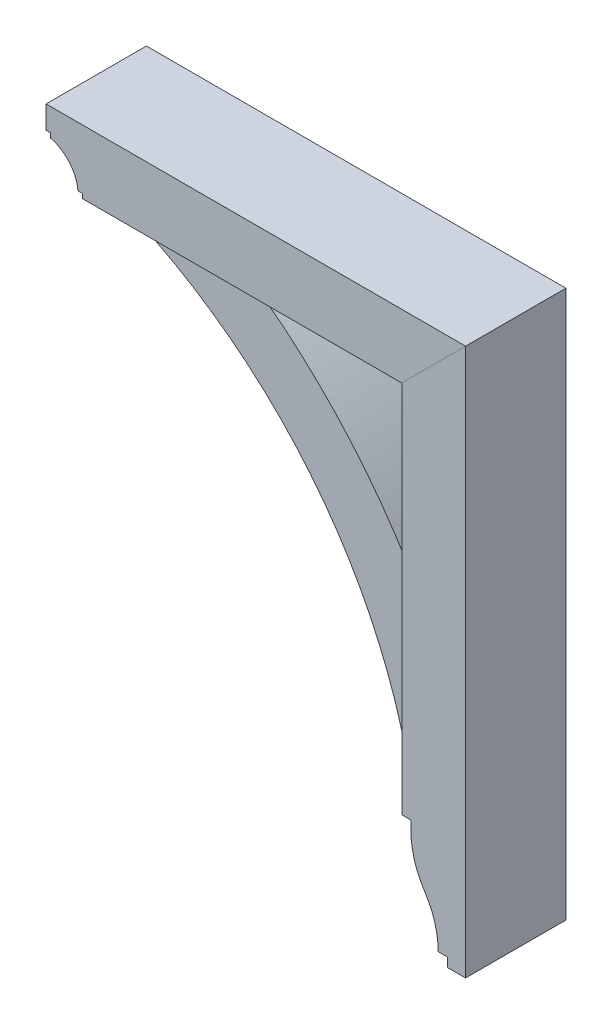
ISO-10303-21;
HEADER;
FILE_DESCRIPTION(('STEP AP214'),'2;1');
FILE_NAME('part.step','',(''),(''),'','','');
FILE_SCHEMA(('AUTOMOTIVE_DESIGN { 1 0 10303 214 1 1 1 1 }'));
ENDSEC;
DATA;
#1=APPLICATION_CONTEXT('core data for automotive mechanical design processes');
#2=APPLICATION_PROTOCOL_DEFINITION('international standard','automotive_design',2000,#1);
#3=PRODUCT_CONTEXT('',#1,'mechanical');
#4=PRODUCT('Part','Part','',(#3));
#5=PRODUCT_RELATED_PRODUCT_CATEGORY('part','',(#4));
#6=PRODUCT_DEFINITION_FORMATION('','',#4);
#7=PRODUCT_DEFINITION_CONTEXT('part definition',#1,'design');
#8=PRODUCT_DEFINITION('design','',#6,#7);
#9=PRODUCT_DEFINITION_SHAPE('','',#8);
#10=(LENGTH_UNIT() NAMED_UNIT(*) SI_UNIT(.MILLI.,.METRE.));
#11=(NAMED_UNIT(*) PLANE_ANGLE_UNIT() SI_UNIT($,.RADIAN.));
#12=(NAMED_UNIT(*) SI_UNIT($,.STERADIAN.) SOLID_ANGLE_UNIT());
#13=UNCERTAINTY_MEASURE_WITH_UNIT(LENGTH_MEASURE(1.E-05),#10,'distance_accuracy_value','');
#14=(GEOMETRIC_REPRESENTATION_CONTEXT(3) GLOBAL_UNCERTAINTY_ASSIGNED_CONTEXT((#13)) GLOBAL_UNIT_ASSIGNED_CONTEXT((#10,
#11,#12)) REPRESENTATION_CONTEXT('',''));
#15=CARTESIAN_POINT('',(0.,0.,0.));
#16=DIRECTION('',(0.,0.,1.));
#17=DIRECTION('',(1.,0.,0.));
#18=AXIS2_PLACEMENT_3D('',#15,#16,#17);
#19=CARTESIAN_POINT('',(246.881223015558,-2.15821431605898E-12,69.85));
#20=DIRECTION('',(1.,0.,0.));
#21=DIRECTION('',(0.,1.,0.));
#22=AXIS2_PLACEMENT_3D('',#19,#20,#21);
#23=PLANE('',#22);
#24=DIRECTION('',(0.,-1.,0.));
#25=VECTOR('',#24,1.);
#26=CARTESIAN_POINT('',(246.881223015558,-2.15821431605898E-12,-69.85));
#27=LINE('',#26,#25);
#28=CARTESIAN_POINT('',(246.881223015556,-183.515,-69.85));
#29=VERTEX_POINT('',#28);
#30=CARTESIAN_POINT('',(246.881223015556,-196.215,-69.85));
#31=VERTEX_POINT('',#30);
#32=EDGE_CURVE('E176',#29,#31,#27,.T.);
#33=ORIENTED_EDGE('',*,*,#32,.T.);
#34=DIRECTION('',(0.,0.,-1.));
#35=VECTOR('',#34,1.);
#36=CARTESIAN_POINT('',(246.881223015556,-196.215,69.85));
#37=LINE('',#36,#35);
#38=CARTESIAN_POINT('',(246.881223015556,-196.215,69.85));
#39=VERTEX_POINT('',#38);
#40=EDGE_CURVE('E12',#39,#31,#37,.T.);
#41=ORIENTED_EDGE('',*,*,#40,.F.);
#42=DIRECTION('',(0.,-1.,0.));
#43=VECTOR('',#42,1.);
#44=CARTESIAN_POINT('',(246.881223015558,-2.15821431605898E-12,69.85));
#45=LINE('',#44,#43);
#46=CARTESIAN_POINT('',(246.881223015556,-183.515,69.85));
#47=VERTEX_POINT('',#46);
#48=EDGE_CURVE('E208',#47,#39,#45,.T.);
#49=ORIENTED_EDGE('',*,*,#48,.F.);
#50=DIRECTION('',(0.,0.,-1.));
#51=VECTOR('',#50,1.);
#52=CARTESIAN_POINT('',(246.881223015556,-183.515,69.85));
#53=LINE('',#52,#51);
#54=EDGE_CURVE('E172',#47,#29,#53,.T.);
#55=ORIENTED_EDGE('',*,*,#54,.T.);
#56=EDGE_LOOP('',(#33,#41,#49,#55));
#57=FACE_BOUND('',#56,.T.);
#58=ADVANCED_FACE('F60',(#57),#23,.F.);
#59=CARTESIAN_POINT('',(362.768723015556,-196.215,69.85));
#60=DIRECTION('',(0.,0.,-1.));
#61=DIRECTION('',(-1.,0.,0.));
#62=AXIS2_PLACEMENT_3D('',#59,#60,#61);
#63=CYLINDRICAL_SURFACE('',#62,115.8875);
#64=CARTESIAN_POINT('',(362.768723015556,-196.215,-69.85));
#65=DIRECTION('',(0.,0.,1.));
#66=DIRECTION('',(1.,0.,0.));
#67=AXIS2_PLACEMENT_3D('',#64,#65,#66);
#68=CIRCLE('',#67,115.8875);
#69=CARTESIAN_POINT('',(266.018608336656,-260.006284403668,-69.85));
#70=VERTEX_POINT('',#69);
#71=EDGE_CURVE('E180',#31,#70,#68,.T.);
#72=ORIENTED_EDGE('',*,*,#71,.T.);
#73=DIRECTION('',(0.,0.,-1.));
#74=VECTOR('',#73,1.);
#75=CARTESIAN_POINT('',(266.018608336656,-260.006284403668,69.85));
#76=LINE('',#75,#74);
#77=CARTESIAN_POINT('',(266.018608336656,-260.006284403668,69.85));
#78=VERTEX_POINT('',#77);
#79=EDGE_CURVE('E69',#78,#70,#76,.T.);
#80=ORIENTED_EDGE('',*,*,#79,.F.);
#81=CARTESIAN_POINT('',(362.768723015556,-196.215,69.85));
#82=DIRECTION('',(0.,0.,1.));
#83=DIRECTION('',(1.,0.,0.));
#84=AXIS2_PLACEMENT_3D('',#81,#82,#83);
#85=CIRCLE('',#84,115.8875);
#86=EDGE_CURVE('E126',#39,#78,#85,.T.);
#87=ORIENTED_EDGE('',*,*,#86,.F.);
#88=ORIENTED_EDGE('',*,*,#40,.T.);
#89=EDGE_LOOP('',(#72,#80,#87,#88));
#90=FACE_BOUND('',#89,.T.);
#91=ADVANCED_FACE('F235',(#90),#63,.T.);
#92=CARTESIAN_POINT('',(170.152056348884,-323.215,69.85));
#93=DIRECTION('',(0.,0.,-1.));
#94=DIRECTION('',(-1.,0.,0.));
#95=AXIS2_PLACEMENT_3D('',#92,#93,#94);
#96=CYLINDRICAL_SURFACE('',#95,114.829166666671);
#97=CARTESIAN_POINT('',(170.152056348884,-323.215,-69.85));
#98=DIRECTION('',(0.,0.,1.));
#99=DIRECTION('',(1.,0.,0.));
#100=AXIS2_PLACEMENT_3D('',#97,#98,#99);
#101=CIRCLE('',#100,114.829166666671);
#102=CARTESIAN_POINT('',(284.981223015555,-323.215,-69.85));
#103=VERTEX_POINT('',#102);
#104=EDGE_CURVE('E184',#103,#70,#101,.T.);
#105=ORIENTED_EDGE('',*,*,#104,.F.);
#106=DIRECTION('',(0.,0.,-1.));
#107=VECTOR('',#106,1.);
#108=CARTESIAN_POINT('',(284.981223015555,-323.215,69.85));
#109=LINE('',#108,#107);
#110=CARTESIAN_POINT('',(284.981223015555,-323.215,69.85));
#111=VERTEX_POINT('',#110);
#112=EDGE_CURVE('E224',#111,#103,#109,.T.);
#113=ORIENTED_EDGE('',*,*,#112,.F.);
#114=CARTESIAN_POINT('',(170.152056348884,-323.215,69.85));
#115=DIRECTION('',(0.,0.,1.));
#116=DIRECTION('',(1.,0.,0.));
#117=AXIS2_PLACEMENT_3D('',#114,#115,#116);
#118=CIRCLE('',#117,114.829166666671);
#119=EDGE_CURVE('E234',#111,#78,#118,.T.);
#120=ORIENTED_EDGE('',*,*,#119,.T.);
#121=ORIENTED_EDGE('',*,*,#79,.T.);
#122=EDGE_LOOP('',(#105,#113,#120,#121));
#123=FACE_BOUND('',#122,.T.);
#124=ADVANCED_FACE('F232',(#123),#96,.F.);
#125=CARTESIAN_POINT('',(0.,-323.215,69.85));
#126=DIRECTION('',(0.,-1.,0.));
#127=DIRECTION('',(0.,0.,-1.));
#128=AXIS2_PLACEMENT_3D('',#125,#126,#127);
#129=PLANE('',#128);
#130=DIRECTION('',(-1.,0.,0.));
#131=VECTOR('',#130,1.);
#132=CARTESIAN_POINT('',(0.,-323.215,-69.85));
#133=LINE('',#132,#131);
#134=CARTESIAN_POINT('',(297.681223015555,-323.215,-69.85));
#135=VERTEX_POINT('',#134);
#136=EDGE_CURVE('E188',#135,#103,#133,.T.);
#137=ORIENTED_EDGE('',*,*,#136,.F.);
#138=DIRECTION('',(0.,0.,-1.));
#139=VECTOR('',#138,1.);
#140=CARTESIAN_POINT('',(297.681223015555,-323.215,69.85));
#141=LINE('',#140,#139);
#142=CARTESIAN_POINT('',(297.681223015555,-323.215,69.85));
#143=VERTEX_POINT('',#142);
#144=EDGE_CURVE('E221',#143,#135,#141,.T.);
#145=ORIENTED_EDGE('',*,*,#144,.F.);
#146=DIRECTION('',(-1.,0.,0.));
#147=VECTOR('',#146,1.);
#148=CARTESIAN_POINT('',(0.,-323.215,69.85));
#149=LINE('',#148,#147);
#150=EDGE_CURVE('E246',#143,#111,#149,.T.);
#151=ORIENTED_EDGE('',*,*,#150,.T.);
#152=ORIENTED_EDGE('',*,*,#112,.T.);
#153=EDGE_LOOP('',(#137,#145,#151,#152));
#154=FACE_BOUND('',#153,.T.);
#155=ADVANCED_FACE('F243',(#154),#129,.T.);
#156=CARTESIAN_POINT('',(297.681223015555,0.,69.85));
#157=DIRECTION('',(-1.,0.,0.));
#158=DIRECTION('',(0.,0.,1.));
#159=AXIS2_PLACEMENT_3D('',#156,#157,#158);
#160=PLANE('',#159);
#161=DIRECTION('',(0.,1.,0.));
#162=VECTOR('',#161,1.);
#163=CARTESIAN_POINT('',(297.681223015555,0.,-69.85));
#164=LINE('',#163,#162);
#165=CARTESIAN_POINT('',(297.681223015555,-335.915,-69.85));
#166=VERTEX_POINT('',#165);
#167=EDGE_CURVE('E192',#166,#135,#164,.T.);
#168=ORIENTED_EDGE('',*,*,#167,.F.);
#169=DIRECTION('',(0.,0.,-1.));
#170=VECTOR('',#169,1.);
#171=CARTESIAN_POINT('',(297.681223015555,-335.915,69.85));
#172=LINE('',#171,#170);
#173=CARTESIAN_POINT('',(297.681223015555,-335.915,69.85));
#174=VERTEX_POINT('',#173);
#175=EDGE_CURVE('E218',#174,#166,#172,.T.);
#176=ORIENTED_EDGE('',*,*,#175,.F.);
#177=DIRECTION('',(0.,1.,0.));
#178=VECTOR('',#177,1.);
#179=CARTESIAN_POINT('',(297.681223015555,0.,69.85));
#180=LINE('',#179,#178);
#181=EDGE_CURVE('E252',#174,#143,#180,.T.);
#182=ORIENTED_EDGE('',*,*,#181,.T.);
#183=ORIENTED_EDGE('',*,*,#144,.T.);
#184=EDGE_LOOP('',(#168,#176,#182,#183));
#185=FACE_BOUND('',#184,.T.);
#186=ADVANCED_FACE('F300',(#185),#160,.T.);
#187=CARTESIAN_POINT('',(7.34134975033387E-13,-335.915000000001,69.85));
#188=DIRECTION('',(0.,-1.,0.));
#189=DIRECTION('',(1.,0.,0.));
#190=AXIS2_PLACEMENT_3D('',#187,#188,#189);
#191=PLANE('',#190);
#192=DIRECTION('',(-1.,0.,0.));
#193=VECTOR('',#192,1.);
#194=CARTESIAN_POINT('',(7.34134975033387E-13,-335.915000000001,-69.85));
#195=LINE('',#194,#193);
#196=CARTESIAN_POINT('',(323.081223015555,-335.915,-69.85));
#197=VERTEX_POINT('',#196);
#198=EDGE_CURVE('E196',#197,#166,#195,.T.);
#199=ORIENTED_EDGE('',*,*,#198,.F.);
#200=DIRECTION('',(0.,0.,-1.));
#201=VECTOR('',#200,1.);
#202=CARTESIAN_POINT('',(323.081223015555,-335.915,69.85));
#203=LINE('',#202,#201);
#204=CARTESIAN_POINT('',(323.081223015555,-335.915,69.85));
#205=VERTEX_POINT('',#204);
#206=EDGE_CURVE('E215',#205,#197,#203,.T.);
#207=ORIENTED_EDGE('',*,*,#206,.F.);
#208=DIRECTION('',(-1.,0.,0.));
#209=VECTOR('',#208,1.);
#210=CARTESIAN_POINT('',(7.34134975033387E-13,-335.915000000001,69.85));
#211=LINE('',#210,#209);
#212=EDGE_CURVE('E260',#205,#174,#211,.T.);
#213=ORIENTED_EDGE('',*,*,#212,.T.);
#214=ORIENTED_EDGE('',*,*,#175,.T.);
#215=EDGE_LOOP('',(#199,#207,#213,#214));
#216=FACE_BOUND('',#215,.T.);
#217=ADVANCED_FACE('F298',(#216),#191,.T.);
#218=CARTESIAN_POINT('',(323.081223015555,0.,69.85));
#219=DIRECTION('',(-1.,0.,0.));
#220=DIRECTION('',(0.,0.,1.));
#221=AXIS2_PLACEMENT_3D('',#218,#219,#220);
#222=PLANE('',#221);
#223=DIRECTION('',(0.,1.,0.));
#224=VECTOR('',#223,1.);
#225=CARTESIAN_POINT('',(323.081223015555,0.,-69.85));
#226=LINE('',#225,#224);
#227=CARTESIAN_POINT('',(323.081223015555,426.085,-69.85));
#228=VERTEX_POINT('',#227);
#229=EDGE_CURVE('E200',#197,#228,#226,.T.);
#230=ORIENTED_EDGE('',*,*,#229,.T.);
#231=DIRECTION('',(0.,0.,-1.));
#232=VECTOR('',#231,1.);
#233=CARTESIAN_POINT('',(323.081223015555,426.085,69.85));
#234=LINE('',#233,#232);
#235=CARTESIAN_POINT('',(323.081223015555,426.085,69.85));
#236=VERTEX_POINT('',#235);
#237=EDGE_CURVE('E163',#236,#228,#234,.T.);
#238=ORIENTED_EDGE('',*,*,#237,.F.);
#239=DIRECTION('',(0.,1.,0.));
#240=VECTOR('',#239,1.);
#241=CARTESIAN_POINT('',(323.081223015555,0.,69.85));
#242=LINE('',#241,#240);
#243=EDGE_CURVE('E152',#205,#236,#242,.T.);
#244=ORIENTED_EDGE('',*,*,#243,.F.);
#245=ORIENTED_EDGE('',*,*,#206,.T.);
#246=EDGE_LOOP('',(#230,#238,#244,#245));
#247=FACE_BOUND('',#246,.T.);
#248=ADVANCED_FACE('F307',(#247),#222,.F.);
#249=CARTESIAN_POINT('',(-51.5018884922205,51.5018884922198,69.85));
#250=DIRECTION('',(0.707106781186552,-0.707106781186543,0.));
#251=DIRECTION('',(0.707106781186543,0.707106781186552,0.));
#252=AXIS2_PLACEMENT_3D('',#249,#250,#251);
#253=PLANE('',#252);
#254=DIRECTION('',(-0.707106781186543,-0.707106781186552,0.));
#255=VECTOR('',#254,1.);
#256=CARTESIAN_POINT('',(-51.5018884922205,51.5018884922198,-69.85));
#257=LINE('',#256,#255);
#258=CARTESIAN_POINT('',(234.181223015556,337.185,-69.85));
#259=VERTEX_POINT('',#258);
#260=EDGE_CURVE('E161',#228,#259,#257,.T.);
#261=ORIENTED_EDGE('',*,*,#260,.T.);
#262=DIRECTION('',(0.,0.,-1.));
#263=VECTOR('',#262,1.);
#264=CARTESIAN_POINT('',(234.181223015556,337.185,69.85));
#265=LINE('',#264,#263);
#266=CARTESIAN_POINT('',(234.181223015556,337.185,69.85));
#267=VERTEX_POINT('',#266);
#268=EDGE_CURVE('E158',#267,#259,#265,.T.);
#269=ORIENTED_EDGE('',*,*,#268,.F.);
#270=DIRECTION('',(-0.707106781186543,-0.707106781186552,0.));
#271=VECTOR('',#270,1.);
#272=CARTESIAN_POINT('',(-51.5018884922205,51.5018884922198,69.85));
#273=LINE('',#272,#271);
#274=EDGE_CURVE('E145',#236,#267,#273,.T.);
#275=ORIENTED_EDGE('',*,*,#274,.F.);
#276=ORIENTED_EDGE('',*,*,#237,.T.);
#277=EDGE_LOOP('',(#261,#269,#275,#276));
#278=FACE_BOUND('',#277,.T.);
#279=ADVANCED_FACE('F159',(#278),#253,.F.);
#280=CARTESIAN_POINT('',(234.181223015556,0.,69.85));
#281=DIRECTION('',(1.,0.,0.));
#282=DIRECTION('',(0.,1.,0.));
#283=AXIS2_PLACEMENT_3D('',#280,#281,#282);
#284=PLANE('',#283);
#285=DIRECTION('',(0.,-1.,0.));
#286=VECTOR('',#285,1.);
#287=CARTESIAN_POINT('',(234.181223015556,0.,-69.85));
#288=LINE('',#287,#286);
#289=CARTESIAN_POINT('',(234.181223015556,-183.515,-69.85));
#290=VERTEX_POINT('',#289);
#291=EDGE_CURVE('E112',#259,#290,#288,.T.);
#292=ORIENTED_EDGE('',*,*,#291,.T.);
#293=DIRECTION('',(0.,0.,-1.));
#294=VECTOR('',#293,1.);
#295=CARTESIAN_POINT('',(234.181223015556,-183.515,69.85));
#296=LINE('',#295,#294);
#297=CARTESIAN_POINT('',(234.181223015556,-183.515,69.85));
#298=VERTEX_POINT('',#297);
#299=EDGE_CURVE('E164',#298,#290,#296,.T.);
#300=ORIENTED_EDGE('',*,*,#299,.F.);
#301=DIRECTION('',(0.,-1.,0.));
#302=VECTOR('',#301,1.);
#303=CARTESIAN_POINT('',(234.181223015556,0.,69.85));
#304=LINE('',#303,#302);
#305=EDGE_CURVE('E149',#267,#298,#304,.T.);
#306=ORIENTED_EDGE('',*,*,#305,.F.);
#307=ORIENTED_EDGE('',*,*,#268,.T.);
#308=EDGE_LOOP('',(#292,#300,#306,#307));
#309=FACE_BOUND('',#308,.T.);
#310=ADVANCED_FACE('F166',(#309),#284,.F.);
#311=CARTESIAN_POINT('',(0.,-183.515,69.85));
#312=DIRECTION('',(0.,1.,0.));
#313=DIRECTION('',(0.,0.,1.));
#314=AXIS2_PLACEMENT_3D('',#311,#312,#313);
#315=PLANE('',#314);
#316=DIRECTION('',(1.,0.,0.));
#317=VECTOR('',#316,1.);
#318=CARTESIAN_POINT('',(0.,-183.515,-69.85));
#319=LINE('',#318,#317);
#320=EDGE_CURVE('E118',#290,#29,#319,.T.);
#321=ORIENTED_EDGE('',*,*,#320,.T.);
#322=ORIENTED_EDGE('',*,*,#54,.F.);
#323=DIRECTION('',(1.,0.,0.));
#324=VECTOR('',#323,1.);
#325=CARTESIAN_POINT('',(0.,-183.515,69.85));
#326=LINE('',#325,#324);
#327=EDGE_CURVE('E77',#298,#47,#326,.T.);
#328=ORIENTED_EDGE('',*,*,#327,.F.);
#329=ORIENTED_EDGE('',*,*,#299,.T.);
#330=EDGE_LOOP('',(#321,#322,#328,#329));
#331=FACE_BOUND('',#330,.T.);
#332=ADVANCED_FACE('F347',(#331),#315,.F.);
#333=CARTESIAN_POINT('',(0.,0.,69.85));
#334=DIRECTION('',(0.,0.,1.));
#335=DIRECTION('',(1.,0.,0.));
#336=AXIS2_PLACEMENT_3D('',#333,#334,#335);
#337=PLANE('',#336);
#338=ORIENTED_EDGE('',*,*,#48,.T.);
#339=ORIENTED_EDGE('',*,*,#86,.T.);
#340=ORIENTED_EDGE('',*,*,#119,.F.);
#341=ORIENTED_EDGE('',*,*,#150,.F.);
#342=ORIENTED_EDGE('',*,*,#181,.F.);
#343=ORIENTED_EDGE('',*,*,#212,.F.);
#344=ORIENTED_EDGE('',*,*,#243,.T.);
#345=ORIENTED_EDGE('',*,*,#274,.T.);
#346=ORIENTED_EDGE('',*,*,#305,.T.);
#347=ORIENTED_EDGE('',*,*,#327,.T.);
#348=EDGE_LOOP('',(#338,#339,#340,#341,#342,#343,#344,#345,#346,#347));
#349=FACE_BOUND('',#348,.T.);
#350=ADVANCED_FACE('F147',(#349),#337,.T.);
#351=CARTESIAN_POINT('',(0.,0.,-69.85));
#352=DIRECTION('',(0.,0.,1.));
#353=DIRECTION('',(1.,0.,0.));
#354=AXIS2_PLACEMENT_3D('',#351,#352,#353);
#355=PLANE('',#354);
#356=ORIENTED_EDGE('',*,*,#32,.F.);
#357=ORIENTED_EDGE('',*,*,#320,.F.);
#358=ORIENTED_EDGE('',*,*,#291,.F.);
#359=ORIENTED_EDGE('',*,*,#260,.F.);
#360=ORIENTED_EDGE('',*,*,#229,.F.);
#361=ORIENTED_EDGE('',*,*,#198,.T.);
#362=ORIENTED_EDGE('',*,*,#167,.T.);
#363=ORIENTED_EDGE('',*,*,#136,.T.);
#364=ORIENTED_EDGE('',*,*,#104,.T.);
#365=ORIENTED_EDGE('',*,*,#71,.F.);
#366=EDGE_LOOP('',(#356,#357,#358,#359,#360,#361,#362,#363,#364,#365));
#367=FACE_BOUND('',#366,.T.);
#368=ADVANCED_FACE('F239',(#367),#355,.F.);
#369=CLOSED_SHELL('',(#58,#91,#124,#155,#186,#217,#248,#279,#310,#332,#350,#368));
#370=MANIFOLD_SOLID_BREP('B2',#369);
#371=CARTESIAN_POINT('',(-460.401944369243,-313.577975646319,44.45));
#372=DIRECTION('',(0.,0.,-1.));
#373=DIRECTION('',(-1.,0.,0.));
#374=AXIS2_PLACEMENT_3D('',#371,#372,#373);
#375=CYLINDRICAL_SURFACE('',#374,792.1625);
#376=CARTESIAN_POINT('',(-460.401944369243,-313.577975646319,-44.45));
#377=DIRECTION('',(0.,0.,1.));
#378=DIRECTION('',(1.,0.,0.));
#379=AXIS2_PLACEMENT_3D('',#376,#377,#378);
#380=CIRCLE('',#379,792.1625);
#381=CARTESIAN_POINT('',(-8.70627698444387,337.185,-44.45));
#382=VERTEX_POINT('',#381);
#383=CARTESIAN_POINT('',(234.181223015556,67.3099999999999,-44.45));
#384=VERTEX_POINT('',#383);
#385=EDGE_CURVE('E521',#382,#384,#380,.F.);
#386=ORIENTED_EDGE('',*,*,#385,.F.);
#387=DIRECTION('',(0.,0.,-1.));
#388=VECTOR('',#387,1.);
#389=CARTESIAN_POINT('',(-8.70627698444387,337.185,44.45));
#390=LINE('',#389,#388);
#391=CARTESIAN_POINT('',(-8.70627698444387,337.185,44.45));
#392=VERTEX_POINT('',#391);
#393=EDGE_CURVE('E58',#392,#382,#390,.T.);
#394=ORIENTED_EDGE('',*,*,#393,.F.);
#395=CARTESIAN_POINT('',(-460.401944369243,-313.577975646319,44.45));
#396=DIRECTION('',(0.,0.,1.));
#397=DIRECTION('',(1.,0.,0.));
#398=AXIS2_PLACEMENT_3D('',#395,#396,#397);
#399=CIRCLE('',#398,792.1625);
#400=CARTESIAN_POINT('',(234.181223015556,67.3099999999999,44.45));
#401=VERTEX_POINT('',#400);
#402=EDGE_CURVE('E539',#392,#401,#399,.F.);
#403=ORIENTED_EDGE('',*,*,#402,.T.);
#404=DIRECTION('',(0.,0.,-1.));
#405=VECTOR('',#404,1.);
#406=CARTESIAN_POINT('',(234.181223015556,67.3099999999999,44.45));
#407=LINE('',#406,#405);
#408=EDGE_CURVE('E450',#401,#384,#407,.T.);
#409=ORIENTED_EDGE('',*,*,#408,.T.);
#410=EDGE_LOOP('',(#386,#394,#403,#409));
#411=FACE_BOUND('',#410,.T.);
#412=ADVANCED_FACE('F433',(#411),#375,.T.);
#413=CARTESIAN_POINT('',(0.,337.185,44.45));
#414=DIRECTION('',(0.,1.,0.));
#415=DIRECTION('',(-1.,0.,0.));
#416=AXIS2_PLACEMENT_3D('',#413,#414,#415);
#417=PLANE('',#416);
#418=DIRECTION('',(1.,0.,0.));
#419=VECTOR('',#418,1.);
#420=CARTESIAN_POINT('',(0.,337.185,-44.45));
#421=LINE('',#420,#419);
#422=CARTESIAN_POINT('',(-134.118776984445,337.185,-44.45));
#423=VERTEX_POINT('',#422);
#424=EDGE_CURVE('E524',#423,#382,#421,.T.);
#425=ORIENTED_EDGE('',*,*,#424,.F.);
#426=DIRECTION('',(0.,0.,-1.));
#427=VECTOR('',#426,1.);
#428=CARTESIAN_POINT('',(-134.118776984445,337.185,44.45));
#429=LINE('',#428,#427);
#430=CARTESIAN_POINT('',(-134.118776984445,337.185,44.45));
#431=VERTEX_POINT('',#430);
#432=EDGE_CURVE('E442',#431,#423,#429,.T.);
#433=ORIENTED_EDGE('',*,*,#432,.F.);
#434=DIRECTION('',(1.,0.,0.));
#435=VECTOR('',#434,1.);
#436=CARTESIAN_POINT('',(0.,337.185,44.45));
#437=LINE('',#436,#435);
#438=EDGE_CURVE('E555',#431,#392,#437,.T.);
#439=ORIENTED_EDGE('',*,*,#438,.T.);
#440=ORIENTED_EDGE('',*,*,#393,.T.);
#441=EDGE_LOOP('',(#425,#433,#439,#440));
#442=FACE_BOUND('',#441,.T.);
#443=ADVANCED_FACE('F554',(#442),#417,.T.);
#444=CARTESIAN_POINT('',(-134.118776984445,0.,44.45));
#445=DIRECTION('',(1.,0.,0.));
#446=DIRECTION('',(0.,0.,-1.));
#447=AXIS2_PLACEMENT_3D('',#444,#445,#446);
#448=PLANE('',#447);
#449=DIRECTION('',(0.,-1.,0.));
#450=VECTOR('',#449,1.);
#451=CARTESIAN_POINT('',(-134.118776984445,0.,-44.45));
#452=LINE('',#451,#450);
#453=CARTESIAN_POINT('',(-134.118776984445,311.785,-44.45));
#454=VERTEX_POINT('',#453);
#455=EDGE_CURVE('E527',#423,#454,#452,.T.);
#456=ORIENTED_EDGE('',*,*,#455,.T.);
#457=DIRECTION('',(0.,0.,-1.));
#458=VECTOR('',#457,1.);
#459=CARTESIAN_POINT('',(-134.118776984445,311.785,44.45));
#460=LINE('',#459,#458);
#461=CARTESIAN_POINT('',(-134.118776984445,311.785,44.45));
#462=VERTEX_POINT('',#461);
#463=EDGE_CURVE('E510',#462,#454,#460,.T.);
#464=ORIENTED_EDGE('',*,*,#463,.F.);
#465=DIRECTION('',(0.,-1.,0.));
#466=VECTOR('',#465,1.);
#467=CARTESIAN_POINT('',(-134.118776984445,0.,44.45));
#468=LINE('',#467,#466);
#469=EDGE_CURVE('E496',#431,#462,#468,.T.);
#470=ORIENTED_EDGE('',*,*,#469,.F.);
#471=ORIENTED_EDGE('',*,*,#432,.T.);
#472=EDGE_LOOP('',(#456,#464,#470,#471));
#473=FACE_BOUND('',#472,.T.);
#474=ADVANCED_FACE('F548',(#473),#448,.F.);
#475=CARTESIAN_POINT('',(-436.930461003759,-285.797286924895,44.45));
#476=DIRECTION('',(0.,0.,-1.));
#477=DIRECTION('',(-1.,0.,0.));
#478=AXIS2_PLACEMENT_3D('',#475,#476,#477);
#479=CYLINDRICAL_SURFACE('',#478,669.925);
#480=CARTESIAN_POINT('',(-436.930461003759,-285.797286924895,-44.45));
#481=DIRECTION('',(0.,0.,1.));
#482=DIRECTION('',(1.,0.,0.));
#483=AXIS2_PLACEMENT_3D('',#480,#481,#482);
#484=CIRCLE('',#483,669.925);
#485=CARTESIAN_POINT('',(208.781223015556,-107.315,-44.45));
#486=VERTEX_POINT('',#485);
#487=EDGE_CURVE('E506',#454,#486,#484,.F.);
#488=ORIENTED_EDGE('',*,*,#487,.T.);
#489=DIRECTION('',(0.,0.,-1.));
#490=VECTOR('',#489,1.);
#491=CARTESIAN_POINT('',(208.781223015556,-107.315,44.45));
#492=LINE('',#491,#490);
#493=CARTESIAN_POINT('',(208.781223015556,-107.315,44.45));
#494=VERTEX_POINT('',#493);
#495=EDGE_CURVE('E503',#494,#486,#492,.T.);
#496=ORIENTED_EDGE('',*,*,#495,.F.);
#497=CARTESIAN_POINT('',(-436.930461003759,-285.797286924895,44.45));
#498=DIRECTION('',(0.,0.,1.));
#499=DIRECTION('',(1.,0.,0.));
#500=AXIS2_PLACEMENT_3D('',#497,#498,#499);
#501=CIRCLE('',#500,669.925);
#502=EDGE_CURVE('E488',#462,#494,#501,.F.);
#503=ORIENTED_EDGE('',*,*,#502,.F.);
#504=ORIENTED_EDGE('',*,*,#463,.T.);
#505=EDGE_LOOP('',(#488,#496,#503,#504));
#506=FACE_BOUND('',#505,.T.);
#507=ADVANCED_FACE('F504',(#506),#479,.F.);
#508=CARTESIAN_POINT('',(0.,-107.315,44.45));
#509=DIRECTION('',(0.,-1.,0.));
#510=DIRECTION('',(1.,0.,0.));
#511=AXIS2_PLACEMENT_3D('',#508,#509,#510);
#512=PLANE('',#511);
#513=DIRECTION('',(-1.,0.,0.));
#514=VECTOR('',#513,1.);
#515=CARTESIAN_POINT('',(0.,-107.315,-44.45));
#516=LINE('',#515,#514);
#517=CARTESIAN_POINT('',(234.181223015556,-107.315,-44.45));
#518=VERTEX_POINT('',#517);
#519=EDGE_CURVE('E532',#518,#486,#516,.T.);
#520=ORIENTED_EDGE('',*,*,#519,.F.);
#521=DIRECTION('',(0.,0.,-1.));
#522=VECTOR('',#521,1.);
#523=CARTESIAN_POINT('',(234.181223015556,-107.315,44.45));
#524=LINE('',#523,#522);
#525=CARTESIAN_POINT('',(234.181223015556,-107.315,44.45));
#526=VERTEX_POINT('',#525);
#527=EDGE_CURVE('E469',#526,#518,#524,.T.);
#528=ORIENTED_EDGE('',*,*,#527,.F.);
#529=DIRECTION('',(-1.,0.,0.));
#530=VECTOR('',#529,1.);
#531=CARTESIAN_POINT('',(0.,-107.315,44.45));
#532=LINE('',#531,#530);
#533=EDGE_CURVE('E493',#526,#494,#532,.T.);
#534=ORIENTED_EDGE('',*,*,#533,.T.);
#535=ORIENTED_EDGE('',*,*,#495,.T.);
#536=EDGE_LOOP('',(#520,#528,#534,#535));
#537=FACE_BOUND('',#536,.T.);
#538=ADVANCED_FACE('F512',(#537),#512,.T.);
#539=CARTESIAN_POINT('',(234.181223015556,0.,44.45));
#540=DIRECTION('',(1.,0.,0.));
#541=DIRECTION('',(0.,1.,0.));
#542=AXIS2_PLACEMENT_3D('',#539,#540,#541);
#543=PLANE('',#542);
#544=DIRECTION('',(0.,-1.,0.));
#545=VECTOR('',#544,1.);
#546=CARTESIAN_POINT('',(234.181223015556,0.,-44.45));
#547=LINE('',#546,#545);
#548=EDGE_CURVE('E535',#384,#518,#547,.T.);
#549=ORIENTED_EDGE('',*,*,#548,.F.);
#550=ORIENTED_EDGE('',*,*,#408,.F.);
#551=DIRECTION('',(0.,-1.,0.));
#552=VECTOR('',#551,1.);
#553=CARTESIAN_POINT('',(234.181223015556,0.,44.45));
#554=LINE('',#553,#552);
#555=EDGE_CURVE('E514',#401,#526,#554,.T.);
#556=ORIENTED_EDGE('',*,*,#555,.T.);
#557=ORIENTED_EDGE('',*,*,#527,.T.);
#558=EDGE_LOOP('',(#549,#550,#556,#557));
#559=FACE_BOUND('',#558,.T.);
#560=ADVANCED_FACE('F556',(#559),#543,.T.);
#561=CARTESIAN_POINT('',(0.,0.,44.45));
#562=DIRECTION('',(0.,0.,1.));
#563=DIRECTION('',(1.,0.,0.));
#564=AXIS2_PLACEMENT_3D('',#561,#562,#563);
#565=PLANE('',#564);
#566=ORIENTED_EDGE('',*,*,#402,.F.);
#567=ORIENTED_EDGE('',*,*,#438,.F.);
#568=ORIENTED_EDGE('',*,*,#469,.T.);
#569=ORIENTED_EDGE('',*,*,#502,.T.);
#570=ORIENTED_EDGE('',*,*,#533,.F.);
#571=ORIENTED_EDGE('',*,*,#555,.F.);
#572=EDGE_LOOP('',(#566,#567,#568,#569,#570,#571));
#573=FACE_BOUND('',#572,.T.);
#574=ADVANCED_FACE('F490',(#573),#565,.T.);
#575=CARTESIAN_POINT('',(0.,0.,-44.45));
#576=DIRECTION('',(0.,0.,1.));
#577=DIRECTION('',(1.,0.,0.));
#578=AXIS2_PLACEMENT_3D('',#575,#576,#577);
#579=PLANE('',#578);
#580=ORIENTED_EDGE('',*,*,#385,.T.);
#581=ORIENTED_EDGE('',*,*,#548,.T.);
#582=ORIENTED_EDGE('',*,*,#519,.T.);
#583=ORIENTED_EDGE('',*,*,#487,.F.);
#584=ORIENTED_EDGE('',*,*,#455,.F.);
#585=ORIENTED_EDGE('',*,*,#424,.T.);
#586=EDGE_LOOP('',(#580,#581,#582,#583,#584,#585));
#587=FACE_BOUND('',#586,.T.);
#588=ADVANCED_FACE('F553',(#587),#579,.F.);
#589=CLOSED_SHELL('',(#412,#443,#474,#507,#538,#560,#574,#588));
#590=MANIFOLD_SOLID_BREP('B6',#589);
#591=CARTESIAN_POINT('',(-254.768776984445,0.,69.85));
#592=DIRECTION('',(-1.,0.,0.));
#593=DIRECTION('',(0.,0.,1.));
#594=AXIS2_PLACEMENT_3D('',#591,#592,#593);
#595=PLANE('',#594);
#596=DIRECTION('',(0.,1.,0.));
#597=VECTOR('',#596,1.);
#598=CARTESIAN_POINT('',(-254.768776984445,0.,-69.85));
#599=LINE('',#598,#597);
#600=CARTESIAN_POINT('',(-254.768776984445,387.985,-69.85));
#601=VERTEX_POINT('',#600);
#602=CARTESIAN_POINT('',(-254.768776984445,394.335,-69.85));
#603=VERTEX_POINT('',#602);
#604=EDGE_CURVE('E749',#601,#603,#599,.T.);
#605=ORIENTED_EDGE('',*,*,#604,.F.);
#606=DIRECTION('',(0.,0.,-1.));
#607=VECTOR('',#606,1.);
#608=CARTESIAN_POINT('',(-254.768776984445,387.985,69.85));
#609=LINE('',#608,#607);
#610=CARTESIAN_POINT('',(-254.768776984445,387.985,69.85));
#611=VERTEX_POINT('',#610);
#612=EDGE_CURVE('E431',#611,#601,#609,.T.);
#613=ORIENTED_EDGE('',*,*,#612,.F.);
#614=DIRECTION('',(0.,1.,0.));
#615=VECTOR('',#614,1.);
#616=CARTESIAN_POINT('',(-254.768776984445,0.,69.85));
#617=LINE('',#616,#615);
#618=CARTESIAN_POINT('',(-254.768776984445,394.335,69.85));
#619=VERTEX_POINT('',#618);
#620=EDGE_CURVE('E780',#611,#619,#617,.T.);
#621=ORIENTED_EDGE('',*,*,#620,.T.);
#622=DIRECTION('',(0.,0.,-1.));
#623=VECTOR('',#622,1.);
#624=CARTESIAN_POINT('',(-254.768776984445,394.335,69.85));
#625=LINE('',#624,#623);
#626=EDGE_CURVE('E660',#619,#603,#625,.T.);
#627=ORIENTED_EDGE('',*,*,#626,.T.);
#628=EDGE_LOOP('',(#605,#613,#621,#627));
#629=FACE_BOUND('',#628,.T.);
#630=ADVANCED_FACE('F643',(#629),#595,.T.);
#631=CARTESIAN_POINT('',(-267.180101736884,338.793150212195,69.85));
#632=DIRECTION('',(0.,0.,-1.));
#633=DIRECTION('',(-1.,0.,0.));
#634=AXIS2_PLACEMENT_3D('',#631,#632,#633);
#635=CYLINDRICAL_SURFACE('',#634,50.7334117486338);
#636=CARTESIAN_POINT('',(-267.180101736884,338.793150212195,-69.85));
#637=DIRECTION('',(0.,0.,1.));
#638=DIRECTION('',(1.,0.,0.));
#639=AXIS2_PLACEMENT_3D('',#636,#637,#638);
#640=CIRCLE('',#639,50.7334117486338);
#641=CARTESIAN_POINT('',(-216.668776984445,343.535,-69.85));
#642=VERTEX_POINT('',#641);
#643=EDGE_CURVE('E752',#601,#642,#640,.F.);
#644=ORIENTED_EDGE('',*,*,#643,.T.);
#645=DIRECTION('',(0.,0.,-1.));
#646=VECTOR('',#645,1.);
#647=CARTESIAN_POINT('',(-216.668776984445,343.535,69.85));
#648=LINE('',#647,#646);
#649=CARTESIAN_POINT('',(-216.668776984445,343.535,69.85));
#650=VERTEX_POINT('',#649);
#651=EDGE_CURVE('E652',#650,#642,#648,.T.);
#652=ORIENTED_EDGE('',*,*,#651,.F.);
#653=CARTESIAN_POINT('',(-267.180101736884,338.793150212195,69.85));
#654=DIRECTION('',(0.,0.,1.));
#655=DIRECTION('',(1.,0.,0.));
#656=AXIS2_PLACEMENT_3D('',#653,#654,#655);
#657=CIRCLE('',#656,50.7334117486338);
#658=EDGE_CURVE('E815',#611,#650,#657,.F.);
#659=ORIENTED_EDGE('',*,*,#658,.F.);
#660=ORIENTED_EDGE('',*,*,#612,.T.);
#661=EDGE_LOOP('',(#644,#652,#659,#660));
#662=FACE_BOUND('',#661,.T.);
#663=ADVANCED_FACE('F804',(#662),#635,.F.);
#664=CARTESIAN_POINT('',(6.00630656322204E-12,343.534999999996,69.85));
#665=DIRECTION('',(0.,-1.,0.));
#666=DIRECTION('',(1.,0.,0.));
#667=AXIS2_PLACEMENT_3D('',#664,#665,#666);
#668=PLANE('',#667);
#669=DIRECTION('',(-1.,0.,0.));
#670=VECTOR('',#669,1.);
#671=CARTESIAN_POINT('',(6.00630656322204E-12,343.534999999996,-69.85));
#672=LINE('',#671,#670);
#673=CARTESIAN_POINT('',(-210.318776984445,343.535,-69.85));
#674=VERTEX_POINT('',#673);
#675=EDGE_CURVE('E755',#674,#642,#672,.T.);
#676=ORIENTED_EDGE('',*,*,#675,.F.);
#677=DIRECTION('',(0.,0.,-1.));
#678=VECTOR('',#677,1.);
#679=CARTESIAN_POINT('',(-210.318776984445,343.535,69.85));
#680=LINE('',#679,#678);
#681=CARTESIAN_POINT('',(-210.318776984445,343.535,69.85));
#682=VERTEX_POINT('',#681);
#683=EDGE_CURVE('E792',#682,#674,#680,.T.);
#684=ORIENTED_EDGE('',*,*,#683,.F.);
#685=DIRECTION('',(-1.,0.,0.));
#686=VECTOR('',#685,1.);
#687=CARTESIAN_POINT('',(6.00630656322204E-12,343.534999999996,69.85));
#688=LINE('',#687,#686);
#689=EDGE_CURVE('E801',#682,#650,#688,.T.);
#690=ORIENTED_EDGE('',*,*,#689,.T.);
#691=ORIENTED_EDGE('',*,*,#651,.T.);
#692=EDGE_LOOP('',(#676,#684,#690,#691));
#693=FACE_BOUND('',#692,.T.);
#694=ADVANCED_FACE('F799',(#693),#668,.T.);
#695=CARTESIAN_POINT('',(-210.318776984445,0.,69.85));
#696=DIRECTION('',(-1.,0.,0.));
#697=DIRECTION('',(0.,0.,1.));
#698=AXIS2_PLACEMENT_3D('',#695,#696,#697);
#699=PLANE('',#698);
#700=DIRECTION('',(0.,1.,0.));
#701=VECTOR('',#700,1.);
#702=CARTESIAN_POINT('',(-210.318776984445,0.,-69.85));
#703=LINE('',#702,#701);
#704=CARTESIAN_POINT('',(-210.318776984445,337.185,-69.85));
#705=VERTEX_POINT('',#704);
#706=EDGE_CURVE('E759',#705,#674,#703,.T.);
#707=ORIENTED_EDGE('',*,*,#706,.F.);
#708=DIRECTION('',(0.,0.,-1.));
#709=VECTOR('',#708,1.);
#710=CARTESIAN_POINT('',(-210.318776984445,337.185,69.85));
#711=LINE('',#710,#709);
#712=CARTESIAN_POINT('',(-210.318776984445,337.185,69.85));
#713=VERTEX_POINT('',#712);
#714=EDGE_CURVE('E790',#713,#705,#711,.T.);
#715=ORIENTED_EDGE('',*,*,#714,.F.);
#716=DIRECTION('',(0.,1.,0.));
#717=VECTOR('',#716,1.);
#718=CARTESIAN_POINT('',(-210.318776984445,0.,69.85));
#719=LINE('',#718,#717);
#720=EDGE_CURVE('E814',#713,#682,#719,.T.);
#721=ORIENTED_EDGE('',*,*,#720,.T.);
#722=ORIENTED_EDGE('',*,*,#683,.T.);
#723=EDGE_LOOP('',(#707,#715,#721,#722));
#724=FACE_BOUND('',#723,.T.);
#725=ADVANCED_FACE('F810',(#724),#699,.T.);
#726=CARTESIAN_POINT('',(0.,337.185,69.85));
#727=DIRECTION('',(0.,1.,0.));
#728=DIRECTION('',(-1.,0.,0.));
#729=AXIS2_PLACEMENT_3D('',#726,#727,#728);
#730=PLANE('',#729);
#731=DIRECTION('',(1.,0.,0.));
#732=VECTOR('',#731,1.);
#733=CARTESIAN_POINT('',(0.,337.185,-69.85));
#734=LINE('',#733,#732);
#735=CARTESIAN_POINT('',(234.181223015556,337.185,-69.85));
#736=VERTEX_POINT('',#735);
#737=EDGE_CURVE('E763',#705,#736,#734,.T.);
#738=ORIENTED_EDGE('',*,*,#737,.T.);
#739=DIRECTION('',(0.,0.,-1.));
#740=VECTOR('',#739,1.);
#741=CARTESIAN_POINT('',(234.181223015556,337.185,69.85));
#742=LINE('',#741,#740);
#743=CARTESIAN_POINT('',(234.181223015556,337.185,69.85));
#744=VERTEX_POINT('',#743);
#745=EDGE_CURVE('E787',#744,#736,#742,.T.);
#746=ORIENTED_EDGE('',*,*,#745,.F.);
#747=DIRECTION('',(1.,0.,0.));
#748=VECTOR('',#747,1.);
#749=CARTESIAN_POINT('',(0.,337.185,69.85));
#750=LINE('',#749,#748);
#751=EDGE_CURVE('E819',#713,#744,#750,.T.);
#752=ORIENTED_EDGE('',*,*,#751,.F.);
#753=ORIENTED_EDGE('',*,*,#714,.T.);
#754=EDGE_LOOP('',(#738,#746,#752,#753));
#755=FACE_BOUND('',#754,.T.);
#756=ADVANCED_FACE('F852',(#755),#730,.F.);
#757=CARTESIAN_POINT('',(-51.5018884922205,51.5018884922198,69.85));
#758=DIRECTION('',(0.707106781186552,-0.707106781186543,0.));
#759=DIRECTION('',(0.707106781186543,0.707106781186552,0.));
#760=AXIS2_PLACEMENT_3D('',#757,#758,#759);
#761=PLANE('',#760);
#762=DIRECTION('',(-0.707106781186543,-0.707106781186552,0.));
#763=VECTOR('',#762,1.);
#764=CARTESIAN_POINT('',(-51.5018884922205,51.5018884922198,-69.85));
#765=LINE('',#764,#763);
#766=CARTESIAN_POINT('',(323.081223015555,426.085,-69.85));
#767=VERTEX_POINT('',#766);
#768=EDGE_CURVE('E767',#767,#736,#765,.T.);
#769=ORIENTED_EDGE('',*,*,#768,.F.);
#770=DIRECTION('',(0.,0.,-1.));
#771=VECTOR('',#770,1.);
#772=CARTESIAN_POINT('',(323.081223015555,426.085,69.85));
#773=LINE('',#772,#771);
#774=CARTESIAN_POINT('',(323.081223015555,426.085,69.85));
#775=VERTEX_POINT('',#774);
#776=EDGE_CURVE('E737',#775,#767,#773,.T.);
#777=ORIENTED_EDGE('',*,*,#776,.F.);
#778=DIRECTION('',(-0.707106781186543,-0.707106781186552,0.));
#779=VECTOR('',#778,1.);
#780=CARTESIAN_POINT('',(-51.5018884922205,51.5018884922198,69.85));
#781=LINE('',#780,#779);
#782=EDGE_CURVE('E725',#775,#744,#781,.T.);
#783=ORIENTED_EDGE('',*,*,#782,.T.);
#784=ORIENTED_EDGE('',*,*,#745,.T.);
#785=EDGE_LOOP('',(#769,#777,#783,#784));
#786=FACE_BOUND('',#785,.T.);
#787=ADVANCED_FACE('F829',(#786),#761,.T.);
#788=CARTESIAN_POINT('',(0.,426.085,69.85));
#789=DIRECTION('',(0.,-1.,0.));
#790=DIRECTION('',(0.,0.,-1.));
#791=AXIS2_PLACEMENT_3D('',#788,#789,#790);
#792=PLANE('',#791);
#793=DIRECTION('',(-1.,0.,0.));
#794=VECTOR('',#793,1.);
#795=CARTESIAN_POINT('',(0.,426.085,-69.85));
#796=LINE('',#795,#794);
#797=CARTESIAN_POINT('',(-261.118776984445,426.085,-69.85));
#798=VERTEX_POINT('',#797);
#799=EDGE_CURVE('E733',#767,#798,#796,.T.);
#800=ORIENTED_EDGE('',*,*,#799,.T.);
#801=DIRECTION('',(0.,0.,-1.));
#802=VECTOR('',#801,1.);
#803=CARTESIAN_POINT('',(-261.118776984445,426.085,69.85));
#804=LINE('',#803,#802);
#805=CARTESIAN_POINT('',(-261.118776984445,426.085,69.85));
#806=VERTEX_POINT('',#805);
#807=EDGE_CURVE('E730',#806,#798,#804,.T.);
#808=ORIENTED_EDGE('',*,*,#807,.F.);
#809=DIRECTION('',(-1.,0.,0.));
#810=VECTOR('',#809,1.);
#811=CARTESIAN_POINT('',(0.,426.085,69.85));
#812=LINE('',#811,#810);
#813=EDGE_CURVE('E717',#775,#806,#812,.T.);
#814=ORIENTED_EDGE('',*,*,#813,.F.);
#815=ORIENTED_EDGE('',*,*,#776,.T.);
#816=EDGE_LOOP('',(#800,#808,#814,#815));
#817=FACE_BOUND('',#816,.T.);
#818=ADVANCED_FACE('F731',(#817),#792,.F.);
#819=CARTESIAN_POINT('',(-261.118776984444,-4.56535556488333E-13,69.85));
#820=DIRECTION('',(1.,0.,0.));
#821=DIRECTION('',(0.,1.,0.));
#822=AXIS2_PLACEMENT_3D('',#819,#820,#821);
#823=PLANE('',#822);
#824=DIRECTION('',(0.,-1.,0.));
#825=VECTOR('',#824,1.);
#826=CARTESIAN_POINT('',(-261.118776984444,-4.56535556488333E-13,-69.85));
#827=LINE('',#826,#825);
#828=CARTESIAN_POINT('',(-261.118776984445,394.335,-69.85));
#829=VERTEX_POINT('',#828);
#830=EDGE_CURVE('E773',#798,#829,#827,.T.);
#831=ORIENTED_EDGE('',*,*,#830,.T.);
#832=DIRECTION('',(0.,0.,-1.));
#833=VECTOR('',#832,1.);
#834=CARTESIAN_POINT('',(-261.118776984445,394.335,69.85));
#835=LINE('',#834,#833);
#836=CARTESIAN_POINT('',(-261.118776984445,394.335,69.85));
#837=VERTEX_POINT('',#836);
#838=EDGE_CURVE('E689',#837,#829,#835,.T.);
#839=ORIENTED_EDGE('',*,*,#838,.F.);
#840=DIRECTION('',(0.,-1.,0.));
#841=VECTOR('',#840,1.);
#842=CARTESIAN_POINT('',(-261.118776984444,-4.56535556488333E-13,69.85));
#843=LINE('',#842,#841);
#844=EDGE_CURVE('E723',#806,#837,#843,.T.);
#845=ORIENTED_EDGE('',*,*,#844,.F.);
#846=ORIENTED_EDGE('',*,*,#807,.T.);
#847=EDGE_LOOP('',(#831,#839,#845,#846));
#848=FACE_BOUND('',#847,.T.);
#849=ADVANCED_FACE('F739',(#848),#823,.F.);
#850=CARTESIAN_POINT('',(0.,394.335,69.85));
#851=DIRECTION('',(0.,-1.,0.));
#852=DIRECTION('',(0.,0.,-1.));
#853=AXIS2_PLACEMENT_3D('',#850,#851,#852);
#854=PLANE('',#853);
#855=DIRECTION('',(-1.,0.,0.));
#856=VECTOR('',#855,1.);
#857=CARTESIAN_POINT('',(0.,394.335,-69.85));
#858=LINE('',#857,#856);
#859=EDGE_CURVE('E776',#603,#829,#858,.T.);
#860=ORIENTED_EDGE('',*,*,#859,.F.);
#861=ORIENTED_EDGE('',*,*,#626,.F.);
#862=DIRECTION('',(-1.,0.,0.));
#863=VECTOR('',#862,1.);
#864=CARTESIAN_POINT('',(0.,394.335,69.85));
#865=LINE('',#864,#863);
#866=EDGE_CURVE('E741',#619,#837,#865,.T.);
#867=ORIENTED_EDGE('',*,*,#866,.T.);
#868=ORIENTED_EDGE('',*,*,#838,.T.);
#869=EDGE_LOOP('',(#860,#861,#867,#868));
#870=FACE_BOUND('',#869,.T.);
#871=ADVANCED_FACE('F831',(#870),#854,.T.);
#872=CARTESIAN_POINT('',(0.,0.,69.85));
#873=DIRECTION('',(0.,0.,1.));
#874=DIRECTION('',(1.,0.,0.));
#875=AXIS2_PLACEMENT_3D('',#872,#873,#874);
#876=PLANE('',#875);
#877=ORIENTED_EDGE('',*,*,#620,.F.);
#878=ORIENTED_EDGE('',*,*,#658,.T.);
#879=ORIENTED_EDGE('',*,*,#689,.F.);
#880=ORIENTED_EDGE('',*,*,#720,.F.);
#881=ORIENTED_EDGE('',*,*,#751,.T.);
#882=ORIENTED_EDGE('',*,*,#782,.F.);
#883=ORIENTED_EDGE('',*,*,#813,.T.);
#884=ORIENTED_EDGE('',*,*,#844,.T.);
#885=ORIENTED_EDGE('',*,*,#866,.F.);
#886=EDGE_LOOP('',(#877,#878,#879,#880,#881,#882,#883,#884,#885));
#887=FACE_BOUND('',#886,.T.);
#888=ADVANCED_FACE('F720',(#887),#876,.T.);
#889=CARTESIAN_POINT('',(0.,0.,-69.85));
#890=DIRECTION('',(0.,0.,1.));
#891=DIRECTION('',(1.,0.,0.));
#892=AXIS2_PLACEMENT_3D('',#889,#890,#891);
#893=PLANE('',#892);
#894=ORIENTED_EDGE('',*,*,#604,.T.);
#895=ORIENTED_EDGE('',*,*,#859,.T.);
#896=ORIENTED_EDGE('',*,*,#830,.F.);
#897=ORIENTED_EDGE('',*,*,#799,.F.);
#898=ORIENTED_EDGE('',*,*,#768,.T.);
#899=ORIENTED_EDGE('',*,*,#737,.F.);
#900=ORIENTED_EDGE('',*,*,#706,.T.);
#901=ORIENTED_EDGE('',*,*,#675,.T.);
#902=ORIENTED_EDGE('',*,*,#643,.F.);
#903=EDGE_LOOP('',(#894,#895,#896,#897,#898,#899,#900,#901,#902));
#904=FACE_BOUND('',#903,.T.);
#905=ADVANCED_FACE('F806',(#904),#893,.F.);
#906=CLOSED_SHELL('',(#630,#663,#694,#725,#756,#787,#818,#849,#871,#888,#905));
#907=MANIFOLD_SOLID_BREP('B52',#906);
#908=ADVANCED_BREP_SHAPE_REPRESENTATION('',(#18,#370,#590,#907),#14);
#909=SHAPE_DEFINITION_REPRESENTATION(#9,#908);
ENDSEC;
END-ISO-10303-21;
